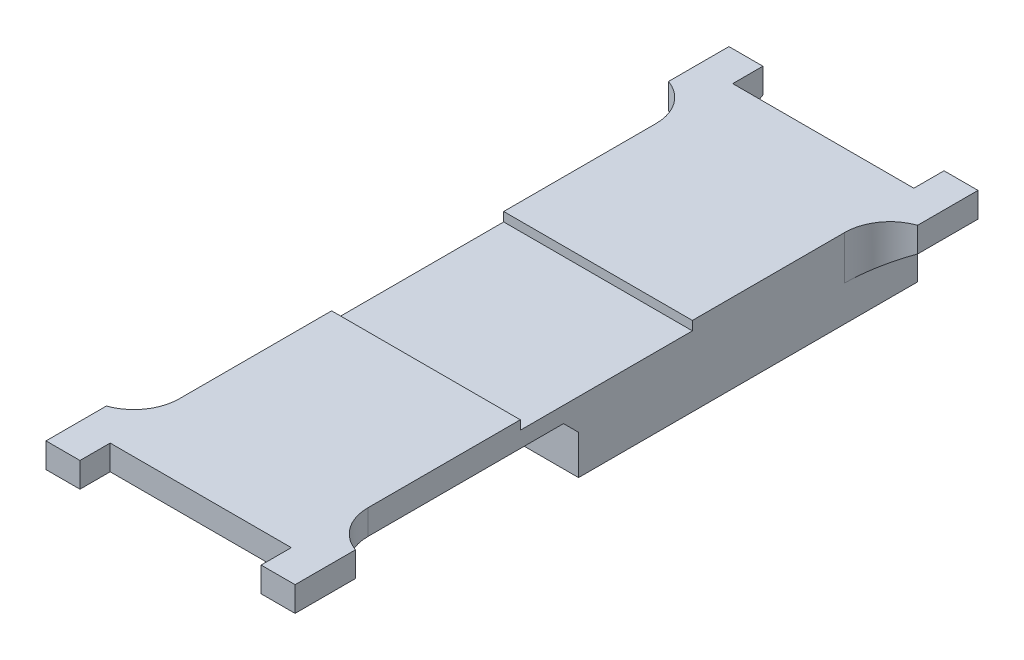
ISO-10303-21;
HEADER;
FILE_DESCRIPTION(('STEP AP214'),'2;1');
FILE_NAME('part.step','',(''),(''),'','','');
FILE_SCHEMA(('AUTOMOTIVE_DESIGN { 1 0 10303 214 1 1 1 1 }'));
ENDSEC;
DATA;
#1=APPLICATION_CONTEXT('core data for automotive mechanical design processes');
#2=APPLICATION_PROTOCOL_DEFINITION('international standard','automotive_design',2000,#1);
#3=PRODUCT_CONTEXT('',#1,'mechanical');
#4=PRODUCT('Part','Part','',(#3));
#5=PRODUCT_RELATED_PRODUCT_CATEGORY('part','',(#4));
#6=PRODUCT_DEFINITION_FORMATION('','',#4);
#7=PRODUCT_DEFINITION_CONTEXT('part definition',#1,'design');
#8=PRODUCT_DEFINITION('design','',#6,#7);
#9=PRODUCT_DEFINITION_SHAPE('','',#8);
#10=(LENGTH_UNIT() NAMED_UNIT(*) SI_UNIT(.MILLI.,.METRE.));
#11=(NAMED_UNIT(*) PLANE_ANGLE_UNIT() SI_UNIT($,.RADIAN.));
#12=(NAMED_UNIT(*) SI_UNIT($,.STERADIAN.) SOLID_ANGLE_UNIT());
#13=UNCERTAINTY_MEASURE_WITH_UNIT(LENGTH_MEASURE(1.E-05),#10,'distance_accuracy_value','');
#14=(GEOMETRIC_REPRESENTATION_CONTEXT(3) GLOBAL_UNCERTAINTY_ASSIGNED_CONTEXT((#13)) GLOBAL_UNIT_ASSIGNED_CONTEXT((#10,
#11,#12)) REPRESENTATION_CONTEXT('',''));
#15=CARTESIAN_POINT('',(0.,0.,0.));
#16=DIRECTION('',(0.,0.,1.));
#17=DIRECTION('',(1.,0.,0.));
#18=AXIS2_PLACEMENT_3D('',#15,#16,#17);
#19=CARTESIAN_POINT('',(0.,5.25,0.));
#20=DIRECTION('',(0.,1.,0.));
#21=DIRECTION('',(0.,0.,1.));
#22=AXIS2_PLACEMENT_3D('',#19,#20,#21);
#23=PLANE('',#22);
#24=DIRECTION('',(0.,0.,-1.));
#25=VECTOR('',#24,1.);
#26=CARTESIAN_POINT('',(-6.,5.25,18.62));
#27=LINE('',#26,#25);
#28=CARTESIAN_POINT('',(-6.,5.25,22.62));
#29=VERTEX_POINT('',#28);
#30=CARTESIAN_POINT('',(-6.,5.25,20.62));
#31=VERTEX_POINT('',#30);
#32=EDGE_CURVE('E262',#29,#31,#27,.T.);
#33=ORIENTED_EDGE('',*,*,#32,.T.);
#34=DIRECTION('',(1.,0.,0.));
#35=VECTOR('',#34,1.);
#36=CARTESIAN_POINT('',(0.,5.25,20.62));
#37=LINE('',#36,#35);
#38=CARTESIAN_POINT('',(6.,5.25,20.62));
#39=VERTEX_POINT('',#38);
#40=EDGE_CURVE('E433',#31,#39,#37,.T.);
#41=ORIENTED_EDGE('',*,*,#40,.T.);
#42=DIRECTION('',(0.,0.,1.));
#43=VECTOR('',#42,1.);
#44=CARTESIAN_POINT('',(6.,5.25,18.62));
#45=LINE('',#44,#43);
#46=CARTESIAN_POINT('',(6.,5.25,22.62));
#47=VERTEX_POINT('',#46);
#48=EDGE_CURVE('E279',#39,#47,#45,.T.);
#49=ORIENTED_EDGE('',*,*,#48,.T.);
#50=DIRECTION('',(1.,0.,0.));
#51=VECTOR('',#50,1.);
#52=CARTESIAN_POINT('',(6.,5.25,22.62));
#53=LINE('',#52,#51);
#54=CARTESIAN_POINT('',(8.25,5.25,22.62));
#55=VERTEX_POINT('',#54);
#56=EDGE_CURVE('E291',#47,#55,#53,.T.);
#57=ORIENTED_EDGE('',*,*,#56,.T.);
#58=DIRECTION('',(0.,0.,-1.));
#59=VECTOR('',#58,1.);
#60=CARTESIAN_POINT('',(8.25,5.25,18.62));
#61=LINE('',#60,#59);
#62=CARTESIAN_POINT('',(8.25,5.25,18.62));
#63=VERTEX_POINT('',#62);
#64=EDGE_CURVE('E295',#55,#63,#61,.T.);
#65=ORIENTED_EDGE('',*,*,#64,.T.);
#66=CARTESIAN_POINT('',(9.25,5.25,15.7915728752538));
#67=DIRECTION('',(0.,1.,0.));
#68=DIRECTION('',(0.,0.,1.));
#69=AXIS2_PLACEMENT_3D('',#66,#67,#68);
#70=CIRCLE('',#69,3.);
#71=CARTESIAN_POINT('',(6.25,5.25,15.7915728752538));
#72=VERTEX_POINT('',#71);
#73=EDGE_CURVE('E471',#63,#72,#70,.F.);
#74=ORIENTED_EDGE('',*,*,#73,.T.);
#75=DIRECTION('',(0.,0.,1.));
#76=VECTOR('',#75,1.);
#77=CARTESIAN_POINT('',(6.24999999999999,5.25,0.));
#78=LINE('',#77,#76);
#79=CARTESIAN_POINT('',(6.24999999999999,5.25,5.7));
#80=VERTEX_POINT('',#79);
#81=EDGE_CURVE('E426',#80,#72,#78,.T.);
#82=ORIENTED_EDGE('',*,*,#81,.F.);
#83=DIRECTION('',(1.,0.,0.));
#84=VECTOR('',#83,1.);
#85=CARTESIAN_POINT('',(-6.24999999999999,5.25,5.7));
#86=LINE('',#85,#84);
#87=CARTESIAN_POINT('',(-6.24999999999999,5.25,5.7));
#88=VERTEX_POINT('',#87);
#89=EDGE_CURVE('E371',#88,#80,#86,.T.);
#90=ORIENTED_EDGE('',*,*,#89,.F.);
#91=DIRECTION('',(0.,0.,1.));
#92=VECTOR('',#91,1.);
#93=CARTESIAN_POINT('',(-6.25,5.25,0.));
#94=LINE('',#93,#92);
#95=CARTESIAN_POINT('',(-6.25,5.25,15.7915728752538));
#96=VERTEX_POINT('',#95);
#97=EDGE_CURVE('E243',#88,#96,#94,.T.);
#98=ORIENTED_EDGE('',*,*,#97,.T.);
#99=CARTESIAN_POINT('',(-9.25,5.25,15.7915728752538));
#100=DIRECTION('',(0.,1.,0.));
#101=DIRECTION('',(0.,0.,1.));
#102=AXIS2_PLACEMENT_3D('',#99,#100,#101);
#103=CIRCLE('',#102,3.);
#104=CARTESIAN_POINT('',(-8.25,5.25,18.62));
#105=VERTEX_POINT('',#104);
#106=EDGE_CURVE('E235',#96,#105,#103,.F.);
#107=ORIENTED_EDGE('',*,*,#106,.T.);
#108=DIRECTION('',(0.,0.,1.));
#109=VECTOR('',#108,1.);
#110=CARTESIAN_POINT('',(-8.25,5.25,18.62));
#111=LINE('',#110,#109);
#112=CARTESIAN_POINT('',(-8.25,5.25,22.62));
#113=VERTEX_POINT('',#112);
#114=EDGE_CURVE('E239',#105,#113,#111,.T.);
#115=ORIENTED_EDGE('',*,*,#114,.T.);
#116=DIRECTION('',(1.,0.,0.));
#117=VECTOR('',#116,1.);
#118=CARTESIAN_POINT('',(-6.,5.25,22.62));
#119=LINE('',#118,#117);
#120=EDGE_CURVE('E261',#113,#29,#119,.T.);
#121=ORIENTED_EDGE('',*,*,#120,.T.);
#122=EDGE_LOOP('',(#33,#41,#49,#57,#65,#74,#82,#90,#98,#107,#115,#121));
#123=FACE_BOUND('',#122,.T.);
#124=ADVANCED_FACE('F43',(#123),#23,.T.);
#125=CARTESIAN_POINT('',(6.24999999999999,5.25,0.));
#126=DIRECTION('',(1.,0.,0.));
#127=DIRECTION('',(0.,0.,-1.));
#128=AXIS2_PLACEMENT_3D('',#125,#126,#127);
#129=PLANE('',#128);
#130=DIRECTION('',(0.,-1.,0.));
#131=VECTOR('',#130,1.);
#132=CARTESIAN_POINT('',(6.24999999999999,5.25,-20.62));
#133=LINE('',#132,#131);
#134=CARTESIAN_POINT('',(6.24999999999999,2.34999999999999,-20.62));
#135=VERTEX_POINT('',#134);
#136=CARTESIAN_POINT('',(6.24999999999999,0.,-20.62));
#137=VERTEX_POINT('',#136);
#138=EDGE_CURVE('E450',#135,#137,#133,.T.);
#139=ORIENTED_EDGE('',*,*,#138,.F.);
#140=DIRECTION('',(0.,0.,1.));
#141=VECTOR('',#140,1.);
#142=CARTESIAN_POINT('',(6.24999999999999,2.34999999999999,0.));
#143=LINE('',#142,#141);
#144=CARTESIAN_POINT('',(6.24999999999999,2.34999999999999,-15.7915728752538));
#145=VERTEX_POINT('',#144);
#146=EDGE_CURVE('E478',#135,#145,#143,.T.);
#147=ORIENTED_EDGE('',*,*,#146,.T.);
#148=DIRECTION('',(0.,-1.,0.));
#149=VECTOR('',#148,1.);
#150=CARTESIAN_POINT('',(6.24999999999999,5.25,-15.7915728752538));
#151=LINE('',#150,#149);
#152=CARTESIAN_POINT('',(6.24999999999999,5.25,-15.7915728752538));
#153=VERTEX_POINT('',#152);
#154=EDGE_CURVE('E456',#145,#153,#151,.F.);
#155=ORIENTED_EDGE('',*,*,#154,.T.);
#156=CARTESIAN_POINT('',(6.24999999999999,5.25,-5.7));
#157=VERTEX_POINT('',#156);
#158=EDGE_CURVE('E422',#153,#157,#78,.T.);
#159=ORIENTED_EDGE('',*,*,#158,.T.);
#160=DIRECTION('',(0.,1.,0.));
#161=VECTOR('',#160,1.);
#162=CARTESIAN_POINT('',(6.24999999999999,4.65,-5.7));
#163=LINE('',#162,#161);
#164=CARTESIAN_POINT('',(6.24999999999999,4.65,-5.7));
#165=VERTEX_POINT('',#164);
#166=EDGE_CURVE('E382',#165,#157,#163,.T.);
#167=ORIENTED_EDGE('',*,*,#166,.F.);
#168=DIRECTION('',(0.,0.,-1.));
#169=VECTOR('',#168,1.);
#170=CARTESIAN_POINT('',(6.24999999999999,4.65,5.7));
#171=LINE('',#170,#169);
#172=CARTESIAN_POINT('',(6.24999999999999,4.65,5.7));
#173=VERTEX_POINT('',#172);
#174=EDGE_CURVE('E366',#173,#165,#171,.T.);
#175=ORIENTED_EDGE('',*,*,#174,.F.);
#176=DIRECTION('',(0.,1.,0.));
#177=VECTOR('',#176,1.);
#178=CARTESIAN_POINT('',(6.24999999999999,4.65,5.7));
#179=LINE('',#178,#177);
#180=EDGE_CURVE('E388',#173,#80,#179,.T.);
#181=ORIENTED_EDGE('',*,*,#180,.T.);
#182=ORIENTED_EDGE('',*,*,#81,.T.);
#183=DIRECTION('',(0.,1.,0.));
#184=VECTOR('',#183,1.);
#185=CARTESIAN_POINT('',(6.25,3.6,15.7915728752538));
#186=LINE('',#185,#184);
#187=CARTESIAN_POINT('',(6.24999999999999,3.6,15.7915728752538));
#188=VERTEX_POINT('',#187);
#189=EDGE_CURVE('E453',#72,#188,#186,.F.);
#190=ORIENTED_EDGE('',*,*,#189,.T.);
#191=DIRECTION('',(0.,0.,-1.));
#192=VECTOR('',#191,1.);
#193=CARTESIAN_POINT('',(6.24999999999999,3.6,1.83999999999999));
#194=LINE('',#193,#192);
#195=CARTESIAN_POINT('',(6.24999999999999,3.6,2.83999999999997));
#196=VERTEX_POINT('',#195);
#197=EDGE_CURVE('E409',#188,#196,#194,.T.);
#198=ORIENTED_EDGE('',*,*,#197,.T.);
#199=DIRECTION('',(0.,-0.707106781186553,-0.707106781186542));
#200=VECTOR('',#199,1.);
#201=CARTESIAN_POINT('',(6.24999999999999,2.6,1.83999999999999));
#202=LINE('',#201,#200);
#203=CARTESIAN_POINT('',(6.24999999999999,2.60000000000001,1.83999999999999));
#204=VERTEX_POINT('',#203);
#205=EDGE_CURVE('E11',#196,#204,#202,.T.);
#206=ORIENTED_EDGE('',*,*,#205,.T.);
#207=DIRECTION('',(0.,-1.,0.));
#208=VECTOR('',#207,1.);
#209=CARTESIAN_POINT('',(6.24999999999999,3.6,1.83999999999999));
#210=LINE('',#209,#208);
#211=CARTESIAN_POINT('',(6.24999999999999,0.,1.83999999999999));
#212=VERTEX_POINT('',#211);
#213=EDGE_CURVE('E418',#204,#212,#210,.T.);
#214=ORIENTED_EDGE('',*,*,#213,.T.);
#215=DIRECTION('',(0.,0.,1.));
#216=VECTOR('',#215,1.);
#217=CARTESIAN_POINT('',(6.24999999999999,0.,0.));
#218=LINE('',#217,#216);
#219=EDGE_CURVE('E421',#137,#212,#218,.T.);
#220=ORIENTED_EDGE('',*,*,#219,.F.);
#221=EDGE_LOOP('',(#139,#147,#155,#159,#167,#175,#181,#182,#190,#198,#206,#214,#220));
#222=FACE_BOUND('',#221,.T.);
#223=ADVANCED_FACE('F583',(#222),#129,.T.);
#224=CARTESIAN_POINT('',(-6.25,5.25,0.));
#225=DIRECTION('',(1.,0.,0.));
#226=DIRECTION('',(0.,0.,-1.));
#227=AXIS2_PLACEMENT_3D('',#224,#225,#226);
#228=PLANE('',#227);
#229=DIRECTION('',(0.,-1.,0.));
#230=VECTOR('',#229,1.);
#231=CARTESIAN_POINT('',(-6.25,5.25,-15.7915728752538));
#232=LINE('',#231,#230);
#233=CARTESIAN_POINT('',(-6.25,5.25,-15.7915728752538));
#234=VERTEX_POINT('',#233);
#235=CARTESIAN_POINT('',(-6.25,2.34999999999999,-15.7915728752538));
#236=VERTEX_POINT('',#235);
#237=EDGE_CURVE('E462',#234,#236,#232,.T.);
#238=ORIENTED_EDGE('',*,*,#237,.T.);
#239=DIRECTION('',(0.,0.,-1.));
#240=VECTOR('',#239,1.);
#241=CARTESIAN_POINT('',(-6.25,2.34999999999999,-20.62));
#242=LINE('',#241,#240);
#243=CARTESIAN_POINT('',(-6.25,2.34999999999999,-20.62));
#244=VERTEX_POINT('',#243);
#245=EDGE_CURVE('E489',#236,#244,#242,.T.);
#246=ORIENTED_EDGE('',*,*,#245,.T.);
#247=DIRECTION('',(0.,-1.,0.));
#248=VECTOR('',#247,1.);
#249=CARTESIAN_POINT('',(-6.25,5.25,-20.62));
#250=LINE('',#249,#248);
#251=CARTESIAN_POINT('',(-6.25,0.,-20.62));
#252=VERTEX_POINT('',#251);
#253=EDGE_CURVE('E436',#244,#252,#250,.T.);
#254=ORIENTED_EDGE('',*,*,#253,.T.);
#255=DIRECTION('',(0.,0.,1.));
#256=VECTOR('',#255,1.);
#257=CARTESIAN_POINT('',(-6.25,0.,0.));
#258=LINE('',#257,#256);
#259=CARTESIAN_POINT('',(-6.25,0.,1.83999999999999));
#260=VERTEX_POINT('',#259);
#261=EDGE_CURVE('E444',#252,#260,#258,.T.);
#262=ORIENTED_EDGE('',*,*,#261,.T.);
#263=DIRECTION('',(0.,-1.,0.));
#264=VECTOR('',#263,1.);
#265=CARTESIAN_POINT('',(-6.25,3.6,1.83999999999999));
#266=LINE('',#265,#264);
#267=CARTESIAN_POINT('',(-6.25,2.60000000000001,1.83999999999999));
#268=VERTEX_POINT('',#267);
#269=EDGE_CURVE('E412',#268,#260,#266,.T.);
#270=ORIENTED_EDGE('',*,*,#269,.F.);
#271=DIRECTION('',(0.,0.707106781186553,0.707106781186542));
#272=VECTOR('',#271,1.);
#273=CARTESIAN_POINT('',(-6.25,3.00500000000003,2.24500000000001));
#274=LINE('',#273,#272);
#275=CARTESIAN_POINT('',(-6.25,3.6,2.83999999999997));
#276=VERTEX_POINT('',#275);
#277=EDGE_CURVE('E53',#268,#276,#274,.T.);
#278=ORIENTED_EDGE('',*,*,#277,.T.);
#279=DIRECTION('',(0.,0.,1.));
#280=VECTOR('',#279,1.);
#281=CARTESIAN_POINT('',(-6.25,3.6,1.83999999999999));
#282=LINE('',#281,#280);
#283=CARTESIAN_POINT('',(-6.25,3.6,15.7915728752538));
#284=VERTEX_POINT('',#283);
#285=EDGE_CURVE('E403',#276,#284,#282,.T.);
#286=ORIENTED_EDGE('',*,*,#285,.T.);
#287=DIRECTION('',(0.,1.,0.));
#288=VECTOR('',#287,1.);
#289=CARTESIAN_POINT('',(-6.25,5.25,15.7915728752538));
#290=LINE('',#289,#288);
#291=EDGE_CURVE('E459',#284,#96,#290,.T.);
#292=ORIENTED_EDGE('',*,*,#291,.T.);
#293=ORIENTED_EDGE('',*,*,#97,.F.);
#294=DIRECTION('',(0.,1.,0.));
#295=VECTOR('',#294,1.);
#296=CARTESIAN_POINT('',(-6.24999999999999,4.65,5.7));
#297=LINE('',#296,#295);
#298=CARTESIAN_POINT('',(-6.24999999999999,4.65,5.7));
#299=VERTEX_POINT('',#298);
#300=EDGE_CURVE('E393',#299,#88,#297,.T.);
#301=ORIENTED_EDGE('',*,*,#300,.F.);
#302=DIRECTION('',(0.,0.,1.));
#303=VECTOR('',#302,1.);
#304=CARTESIAN_POINT('',(-6.24999999999999,4.65,5.7));
#305=LINE('',#304,#303);
#306=CARTESIAN_POINT('',(-6.24999999999999,4.65,-5.7));
#307=VERTEX_POINT('',#306);
#308=EDGE_CURVE('E375',#307,#299,#305,.T.);
#309=ORIENTED_EDGE('',*,*,#308,.F.);
#310=DIRECTION('',(0.,1.,0.));
#311=VECTOR('',#310,1.);
#312=CARTESIAN_POINT('',(-6.24999999999999,4.65,-5.7));
#313=LINE('',#312,#311);
#314=CARTESIAN_POINT('',(-6.24999999999999,5.25,-5.7));
#315=VERTEX_POINT('',#314);
#316=EDGE_CURVE('E396',#307,#315,#313,.T.);
#317=ORIENTED_EDGE('',*,*,#316,.T.);
#318=EDGE_CURVE('E430',#234,#315,#94,.T.);
#319=ORIENTED_EDGE('',*,*,#318,.F.);
#320=EDGE_LOOP('',(#238,#246,#254,#262,#270,#278,#286,#292,#293,#301,#309,#317,#319));
#321=FACE_BOUND('',#320,.T.);
#322=ADVANCED_FACE('F593',(#321),#228,.F.);
#323=CARTESIAN_POINT('',(0.,0.,0.));
#324=DIRECTION('',(0.,1.,0.));
#325=DIRECTION('',(0.,0.,1.));
#326=AXIS2_PLACEMENT_3D('',#323,#324,#325);
#327=PLANE('',#326);
#328=DIRECTION('',(-1.,0.,0.));
#329=VECTOR('',#328,1.);
#330=CARTESIAN_POINT('',(-6.25,0.,1.83999999999999));
#331=LINE('',#330,#329);
#332=EDGE_CURVE('E392',#212,#260,#331,.T.);
#333=ORIENTED_EDGE('',*,*,#332,.T.);
#334=ORIENTED_EDGE('',*,*,#261,.F.);
#335=DIRECTION('',(1.,0.,0.));
#336=VECTOR('',#335,1.);
#337=CARTESIAN_POINT('',(0.,0.,-20.62));
#338=LINE('',#337,#336);
#339=EDGE_CURVE('E440',#252,#137,#338,.T.);
#340=ORIENTED_EDGE('',*,*,#339,.T.);
#341=ORIENTED_EDGE('',*,*,#219,.T.);
#342=EDGE_LOOP('',(#333,#334,#340,#341));
#343=FACE_BOUND('',#342,.T.);
#344=ADVANCED_FACE('F698',(#343),#327,.F.);
#345=CARTESIAN_POINT('',(0.,5.25,-20.62));
#346=DIRECTION('',(0.,0.,-1.));
#347=DIRECTION('',(-1.,0.,0.));
#348=AXIS2_PLACEMENT_3D('',#345,#346,#347);
#349=PLANE('',#348);
#350=DIRECTION('',(0.,1.,0.));
#351=VECTOR('',#350,1.);
#352=CARTESIAN_POINT('',(6.,5.25,-20.62));
#353=LINE('',#352,#351);
#354=CARTESIAN_POINT('',(6.,2.34999999999999,-20.62));
#355=VERTEX_POINT('',#354);
#356=CARTESIAN_POINT('',(6.,5.25,-20.62));
#357=VERTEX_POINT('',#356);
#358=EDGE_CURVE('E332',#355,#357,#353,.T.);
#359=ORIENTED_EDGE('',*,*,#358,.F.);
#360=DIRECTION('',(1.,0.,0.));
#361=VECTOR('',#360,1.);
#362=CARTESIAN_POINT('',(0.,2.34999999999999,-20.62));
#363=LINE('',#362,#361);
#364=EDGE_CURVE('E486',#355,#135,#363,.T.);
#365=ORIENTED_EDGE('',*,*,#364,.T.);
#366=ORIENTED_EDGE('',*,*,#138,.T.);
#367=ORIENTED_EDGE('',*,*,#339,.F.);
#368=ORIENTED_EDGE('',*,*,#253,.F.);
#369=DIRECTION('',(1.,0.,0.));
#370=VECTOR('',#369,1.);
#371=CARTESIAN_POINT('',(0.,2.34999999999999,-20.62));
#372=LINE('',#371,#370);
#373=CARTESIAN_POINT('',(-6.,2.34999999999999,-20.62));
#374=VERTEX_POINT('',#373);
#375=EDGE_CURVE('E482',#244,#374,#372,.T.);
#376=ORIENTED_EDGE('',*,*,#375,.T.);
#377=DIRECTION('',(0.,-1.,0.));
#378=VECTOR('',#377,1.);
#379=CARTESIAN_POINT('',(-6.,5.25,-20.62));
#380=LINE('',#379,#378);
#381=CARTESIAN_POINT('',(-6.,5.25,-20.62));
#382=VERTEX_POINT('',#381);
#383=EDGE_CURVE('E356',#382,#374,#380,.T.);
#384=ORIENTED_EDGE('',*,*,#383,.F.);
#385=DIRECTION('',(1.,0.,0.));
#386=VECTOR('',#385,1.);
#387=CARTESIAN_POINT('',(0.,5.25,-20.62));
#388=LINE('',#387,#386);
#389=EDGE_CURVE('E425',#382,#357,#388,.T.);
#390=ORIENTED_EDGE('',*,*,#389,.T.);
#391=EDGE_LOOP('',(#359,#365,#366,#367,#368,#376,#384,#390));
#392=FACE_BOUND('',#391,.T.);
#393=ADVANCED_FACE('F624',(#392),#349,.T.);
#394=CARTESIAN_POINT('',(0.,5.25,20.62));
#395=DIRECTION('',(0.,0.,-1.));
#396=DIRECTION('',(-1.,0.,0.));
#397=AXIS2_PLACEMENT_3D('',#394,#395,#396);
#398=PLANE('',#397);
#399=ORIENTED_EDGE('',*,*,#40,.F.);
#400=DIRECTION('',(0.,-1.,0.));
#401=VECTOR('',#400,1.);
#402=CARTESIAN_POINT('',(-6.,5.25,20.62));
#403=LINE('',#402,#401);
#404=CARTESIAN_POINT('',(-6.,3.6,20.62));
#405=VERTEX_POINT('',#404);
#406=EDGE_CURVE('E275',#31,#405,#403,.T.);
#407=ORIENTED_EDGE('',*,*,#406,.T.);
#408=DIRECTION('',(1.,0.,0.));
#409=VECTOR('',#408,1.);
#410=CARTESIAN_POINT('',(-6.25,3.6,20.62));
#411=LINE('',#410,#409);
#412=CARTESIAN_POINT('',(6.,3.6,20.62));
#413=VERTEX_POINT('',#412);
#414=EDGE_CURVE('E406',#405,#413,#411,.T.);
#415=ORIENTED_EDGE('',*,*,#414,.T.);
#416=DIRECTION('',(0.,1.,0.));
#417=VECTOR('',#416,1.);
#418=CARTESIAN_POINT('',(6.,5.25,20.62));
#419=LINE('',#418,#417);
#420=EDGE_CURVE('E312',#413,#39,#419,.T.);
#421=ORIENTED_EDGE('',*,*,#420,.T.);
#422=EDGE_LOOP('',(#399,#407,#415,#421));
#423=FACE_BOUND('',#422,.T.);
#424=ADVANCED_FACE('F561',(#423),#398,.F.);
#425=ORIENTED_EDGE('',*,*,#158,.F.);
#426=CARTESIAN_POINT('',(9.24999999999999,5.25,-15.7915728752538));
#427=DIRECTION('',(0.,1.,0.));
#428=DIRECTION('',(0.,0.,1.));
#429=AXIS2_PLACEMENT_3D('',#426,#427,#428);
#430=CIRCLE('',#429,3.);
#431=CARTESIAN_POINT('',(8.25,5.25,-18.62));
#432=VERTEX_POINT('',#431);
#433=EDGE_CURVE('E465',#153,#432,#430,.F.);
#434=ORIENTED_EDGE('',*,*,#433,.T.);
#435=DIRECTION('',(0.,0.,-1.));
#436=VECTOR('',#435,1.);
#437=CARTESIAN_POINT('',(8.25,5.25,-18.62));
#438=LINE('',#437,#436);
#439=CARTESIAN_POINT('',(8.25,5.25,-22.62));
#440=VERTEX_POINT('',#439);
#441=EDGE_CURVE('E320',#432,#440,#438,.T.);
#442=ORIENTED_EDGE('',*,*,#441,.T.);
#443=DIRECTION('',(-1.,0.,0.));
#444=VECTOR('',#443,1.);
#445=CARTESIAN_POINT('',(6.,5.25,-22.62));
#446=LINE('',#445,#444);
#447=CARTESIAN_POINT('',(6.,5.25,-22.62));
#448=VERTEX_POINT('',#447);
#449=EDGE_CURVE('E324',#440,#448,#446,.T.);
#450=ORIENTED_EDGE('',*,*,#449,.T.);
#451=DIRECTION('',(0.,0.,1.));
#452=VECTOR('',#451,1.);
#453=CARTESIAN_POINT('',(6.,5.25,-18.62));
#454=LINE('',#453,#452);
#455=EDGE_CURVE('E316',#448,#357,#454,.T.);
#456=ORIENTED_EDGE('',*,*,#455,.T.);
#457=ORIENTED_EDGE('',*,*,#389,.F.);
#458=DIRECTION('',(0.,0.,-1.));
#459=VECTOR('',#458,1.);
#460=CARTESIAN_POINT('',(-6.,5.25,-18.62));
#461=LINE('',#460,#459);
#462=CARTESIAN_POINT('',(-6.,5.25,-22.62));
#463=VERTEX_POINT('',#462);
#464=EDGE_CURVE('E341',#382,#463,#461,.T.);
#465=ORIENTED_EDGE('',*,*,#464,.T.);
#466=DIRECTION('',(-1.,0.,0.));
#467=VECTOR('',#466,1.);
#468=CARTESIAN_POINT('',(-6.,5.25,-22.62));
#469=LINE('',#468,#467);
#470=CARTESIAN_POINT('',(-8.25,5.25,-22.62));
#471=VERTEX_POINT('',#470);
#472=EDGE_CURVE('E344',#463,#471,#469,.T.);
#473=ORIENTED_EDGE('',*,*,#472,.T.);
#474=DIRECTION('',(0.,0.,1.));
#475=VECTOR('',#474,1.);
#476=CARTESIAN_POINT('',(-8.25,5.25,-18.62));
#477=LINE('',#476,#475);
#478=CARTESIAN_POINT('',(-8.25,5.25,-18.62));
#479=VERTEX_POINT('',#478);
#480=EDGE_CURVE('E348',#471,#479,#477,.T.);
#481=ORIENTED_EDGE('',*,*,#480,.T.);
#482=CARTESIAN_POINT('',(-9.25,5.25,-15.7915728752538));
#483=DIRECTION('',(0.,1.,0.));
#484=DIRECTION('',(0.,0.,1.));
#485=AXIS2_PLACEMENT_3D('',#482,#483,#484);
#486=CIRCLE('',#485,3.);
#487=EDGE_CURVE('E468',#479,#234,#486,.F.);
#488=ORIENTED_EDGE('',*,*,#487,.T.);
#489=ORIENTED_EDGE('',*,*,#318,.T.);
#490=DIRECTION('',(-1.,0.,0.));
#491=VECTOR('',#490,1.);
#492=CARTESIAN_POINT('',(-6.24999999999999,5.25,-5.7));
#493=LINE('',#492,#491);
#494=EDGE_CURVE('E365',#157,#315,#493,.T.);
#495=ORIENTED_EDGE('',*,*,#494,.F.);
#496=EDGE_LOOP('',(#425,#434,#442,#450,#456,#457,#465,#473,#481,#488,#489,#495));
#497=FACE_BOUND('',#496,.T.);
#498=ADVANCED_FACE('F609',(#497),#23,.T.);
#499=CARTESIAN_POINT('',(-6.25,3.6,1.83999999999999));
#500=DIRECTION('',(0.,0.,1.));
#501=DIRECTION('',(1.,0.,0.));
#502=AXIS2_PLACEMENT_3D('',#499,#500,#501);
#503=PLANE('',#502);
#504=ORIENTED_EDGE('',*,*,#213,.F.);
#505=DIRECTION('',(-1.,0.,0.));
#506=VECTOR('',#505,1.);
#507=CARTESIAN_POINT('',(-6.25,2.60000000000001,1.83999999999999));
#508=LINE('',#507,#506);
#509=EDGE_CURVE('E524',#204,#268,#508,.T.);
#510=ORIENTED_EDGE('',*,*,#509,.T.);
#511=ORIENTED_EDGE('',*,*,#269,.T.);
#512=ORIENTED_EDGE('',*,*,#332,.F.);
#513=EDGE_LOOP('',(#504,#510,#511,#512));
#514=FACE_BOUND('',#513,.T.);
#515=ADVANCED_FACE('F617',(#514),#503,.T.);
#516=CARTESIAN_POINT('',(0.,3.6,0.));
#517=DIRECTION('',(0.,1.,0.));
#518=DIRECTION('',(0.,0.,1.));
#519=AXIS2_PLACEMENT_3D('',#516,#517,#518);
#520=PLANE('',#519);
#521=ORIENTED_EDGE('',*,*,#285,.F.);
#522=DIRECTION('',(1.,0.,0.));
#523=VECTOR('',#522,1.);
#524=CARTESIAN_POINT('',(0.,3.6,2.83999999999997));
#525=LINE('',#524,#523);
#526=EDGE_CURVE('E60',#276,#196,#525,.T.);
#527=ORIENTED_EDGE('',*,*,#526,.T.);
#528=ORIENTED_EDGE('',*,*,#197,.F.);
#529=CARTESIAN_POINT('',(9.25,3.6,15.7915728752538));
#530=DIRECTION('',(0.,1.,0.));
#531=DIRECTION('',(0.,0.,1.));
#532=AXIS2_PLACEMENT_3D('',#529,#530,#531);
#533=CIRCLE('',#532,3.);
#534=CARTESIAN_POINT('',(8.25,3.6,18.62));
#535=VERTEX_POINT('',#534);
#536=EDGE_CURVE('E250',#188,#535,#533,.T.);
#537=ORIENTED_EDGE('',*,*,#536,.T.);
#538=DIRECTION('',(0.,0.,1.));
#539=VECTOR('',#538,1.);
#540=CARTESIAN_POINT('',(8.25,3.6,18.62));
#541=LINE('',#540,#539);
#542=CARTESIAN_POINT('',(8.25,3.6,22.62));
#543=VERTEX_POINT('',#542);
#544=EDGE_CURVE('E284',#535,#543,#541,.T.);
#545=ORIENTED_EDGE('',*,*,#544,.T.);
#546=DIRECTION('',(-1.,0.,0.));
#547=VECTOR('',#546,1.);
#548=CARTESIAN_POINT('',(6.,3.6,22.62));
#549=LINE('',#548,#547);
#550=CARTESIAN_POINT('',(6.,3.6,22.62));
#551=VERTEX_POINT('',#550);
#552=EDGE_CURVE('E281',#543,#551,#549,.T.);
#553=ORIENTED_EDGE('',*,*,#552,.T.);
#554=DIRECTION('',(0.,0.,-1.));
#555=VECTOR('',#554,1.);
#556=CARTESIAN_POINT('',(6.,3.6,18.62));
#557=LINE('',#556,#555);
#558=EDGE_CURVE('E288',#551,#413,#557,.T.);
#559=ORIENTED_EDGE('',*,*,#558,.T.);
#560=ORIENTED_EDGE('',*,*,#414,.F.);
#561=DIRECTION('',(0.,0.,1.));
#562=VECTOR('',#561,1.);
#563=CARTESIAN_POINT('',(-6.,3.6,18.62));
#564=LINE('',#563,#562);
#565=CARTESIAN_POINT('',(-6.,3.6,22.62));
#566=VERTEX_POINT('',#565);
#567=EDGE_CURVE('E280',#405,#566,#564,.T.);
#568=ORIENTED_EDGE('',*,*,#567,.T.);
#569=DIRECTION('',(-1.,0.,0.));
#570=VECTOR('',#569,1.);
#571=CARTESIAN_POINT('',(-6.,3.6,22.62));
#572=LINE('',#571,#570);
#573=CARTESIAN_POINT('',(-8.25,3.6,22.62));
#574=VERTEX_POINT('',#573);
#575=EDGE_CURVE('E543',#566,#574,#572,.T.);
#576=ORIENTED_EDGE('',*,*,#575,.T.);
#577=DIRECTION('',(0.,0.,-1.));
#578=VECTOR('',#577,1.);
#579=CARTESIAN_POINT('',(-8.25,3.6,18.62));
#580=LINE('',#579,#578);
#581=CARTESIAN_POINT('',(-8.25,3.6,18.62));
#582=VERTEX_POINT('',#581);
#583=EDGE_CURVE('E546',#574,#582,#580,.T.);
#584=ORIENTED_EDGE('',*,*,#583,.T.);
#585=CARTESIAN_POINT('',(-9.25,3.6,15.7915728752538));
#586=DIRECTION('',(0.,1.,0.));
#587=DIRECTION('',(0.,0.,1.));
#588=AXIS2_PLACEMENT_3D('',#585,#586,#587);
#589=CIRCLE('',#588,3.);
#590=EDGE_CURVE('E249',#582,#284,#589,.T.);
#591=ORIENTED_EDGE('',*,*,#590,.T.);
#592=EDGE_LOOP('',(#521,#527,#528,#537,#545,#553,#559,#560,#568,#576,#584,#591));
#593=FACE_BOUND('',#592,.T.);
#594=ADVANCED_FACE('F595',(#593),#520,.F.);
#595=CARTESIAN_POINT('',(-6.24999999999999,4.65,5.7));
#596=DIRECTION('',(0.,0.,1.));
#597=DIRECTION('',(1.,0.,0.));
#598=AXIS2_PLACEMENT_3D('',#595,#596,#597);
#599=PLANE('',#598);
#600=ORIENTED_EDGE('',*,*,#89,.T.);
#601=ORIENTED_EDGE('',*,*,#180,.F.);
#602=DIRECTION('',(1.,0.,0.));
#603=VECTOR('',#602,1.);
#604=CARTESIAN_POINT('',(-6.24999999999999,4.65,5.7));
#605=LINE('',#604,#603);
#606=EDGE_CURVE('E378',#299,#173,#605,.T.);
#607=ORIENTED_EDGE('',*,*,#606,.F.);
#608=ORIENTED_EDGE('',*,*,#300,.T.);
#609=EDGE_LOOP('',(#600,#601,#607,#608));
#610=FACE_BOUND('',#609,.T.);
#611=ADVANCED_FACE('F588',(#610),#599,.F.);
#612=CARTESIAN_POINT('',(-6.24999999999999,4.65,-5.7));
#613=DIRECTION('',(0.,0.,-1.));
#614=DIRECTION('',(-1.,0.,0.));
#615=AXIS2_PLACEMENT_3D('',#612,#613,#614);
#616=PLANE('',#615);
#617=ORIENTED_EDGE('',*,*,#494,.T.);
#618=ORIENTED_EDGE('',*,*,#316,.F.);
#619=DIRECTION('',(-1.,0.,0.));
#620=VECTOR('',#619,1.);
#621=CARTESIAN_POINT('',(-6.24999999999999,4.65,-5.7));
#622=LINE('',#621,#620);
#623=EDGE_CURVE('E370',#165,#307,#622,.T.);
#624=ORIENTED_EDGE('',*,*,#623,.F.);
#625=ORIENTED_EDGE('',*,*,#166,.T.);
#626=EDGE_LOOP('',(#617,#618,#624,#625));
#627=FACE_BOUND('',#626,.T.);
#628=ADVANCED_FACE('F671',(#627),#616,.F.);
#629=CARTESIAN_POINT('',(0.,4.65,0.));
#630=DIRECTION('',(0.,-1.,0.));
#631=DIRECTION('',(0.,0.,-1.));
#632=AXIS2_PLACEMENT_3D('',#629,#630,#631);
#633=PLANE('',#632);
#634=ORIENTED_EDGE('',*,*,#174,.T.);
#635=ORIENTED_EDGE('',*,*,#623,.T.);
#636=ORIENTED_EDGE('',*,*,#308,.T.);
#637=ORIENTED_EDGE('',*,*,#606,.T.);
#638=EDGE_LOOP('',(#634,#635,#636,#637));
#639=FACE_BOUND('',#638,.T.);
#640=ADVANCED_FACE('F591',(#639),#633,.F.);
#641=CARTESIAN_POINT('',(-6.,-0.989389937671457,-18.62));
#642=DIRECTION('',(1.,0.,0.));
#643=DIRECTION('',(0.,0.,-1.));
#644=AXIS2_PLACEMENT_3D('',#641,#642,#643);
#645=PLANE('',#644);
#646=ORIENTED_EDGE('',*,*,#464,.F.);
#647=ORIENTED_EDGE('',*,*,#383,.T.);
#648=DIRECTION('',(0.,0.529919264233202,-0.848048096156428));
#649=VECTOR('',#648,1.);
#650=CARTESIAN_POINT('',(-6.,2.34999999999999,-20.62));
#651=LINE('',#650,#649);
#652=CARTESIAN_POINT('',(-6.,3.59973870381863,-22.62));
#653=VERTEX_POINT('',#652);
#654=EDGE_CURVE('E508',#374,#653,#651,.T.);
#655=ORIENTED_EDGE('',*,*,#654,.T.);
#656=DIRECTION('',(0.,1.,0.));
#657=VECTOR('',#656,1.);
#658=CARTESIAN_POINT('',(-6.,-0.989389937671457,-22.62));
#659=LINE('',#658,#657);
#660=EDGE_CURVE('E352',#653,#463,#659,.T.);
#661=ORIENTED_EDGE('',*,*,#660,.T.);
#662=EDGE_LOOP('',(#646,#647,#655,#661));
#663=FACE_BOUND('',#662,.T.);
#664=ADVANCED_FACE('F650',(#663),#645,.T.);
#665=CARTESIAN_POINT('',(-8.25,-0.989389937671457,-18.62));
#666=DIRECTION('',(-1.,0.,0.));
#667=DIRECTION('',(0.,0.,1.));
#668=AXIS2_PLACEMENT_3D('',#665,#666,#667);
#669=PLANE('',#668);
#670=DIRECTION('',(0.,1.,0.));
#671=VECTOR('',#670,1.);
#672=CARTESIAN_POINT('',(-8.25,-0.989389937671457,-22.62));
#673=LINE('',#672,#671);
#674=CARTESIAN_POINT('',(-8.25,3.59973870381863,-22.62));
#675=VERTEX_POINT('',#674);
#676=EDGE_CURVE('E357',#675,#471,#673,.T.);
#677=ORIENTED_EDGE('',*,*,#676,.F.);
#678=DIRECTION('',(0.,0.,-1.));
#679=VECTOR('',#678,1.);
#680=CARTESIAN_POINT('',(-8.25,3.59973870381863,0.));
#681=LINE('',#680,#679);
#682=CARTESIAN_POINT('',(-8.25,3.59973870381863,-18.62));
#683=VERTEX_POINT('',#682);
#684=EDGE_CURVE('E520',#675,#683,#681,.F.);
#685=ORIENTED_EDGE('',*,*,#684,.T.);
#686=DIRECTION('',(0.,1.,0.));
#687=VECTOR('',#686,1.);
#688=CARTESIAN_POINT('',(-8.25,-0.989389937671457,-18.62));
#689=LINE('',#688,#687);
#690=EDGE_CURVE('E353',#683,#479,#689,.T.);
#691=ORIENTED_EDGE('',*,*,#690,.T.);
#692=ORIENTED_EDGE('',*,*,#480,.F.);
#693=EDGE_LOOP('',(#677,#685,#691,#692));
#694=FACE_BOUND('',#693,.T.);
#695=ADVANCED_FACE('F665',(#694),#669,.T.);
#696=CARTESIAN_POINT('',(-6.,-0.989389937671457,-22.62));
#697=DIRECTION('',(0.,0.,-1.));
#698=DIRECTION('',(-1.,0.,0.));
#699=AXIS2_PLACEMENT_3D('',#696,#697,#698);
#700=PLANE('',#699);
#701=DIRECTION('',(-1.,0.,0.));
#702=VECTOR('',#701,1.);
#703=CARTESIAN_POINT('',(0.,3.59973870381863,-22.62));
#704=LINE('',#703,#702);
#705=EDGE_CURVE('E512',#653,#675,#704,.T.);
#706=ORIENTED_EDGE('',*,*,#705,.T.);
#707=ORIENTED_EDGE('',*,*,#676,.T.);
#708=ORIENTED_EDGE('',*,*,#472,.F.);
#709=ORIENTED_EDGE('',*,*,#660,.F.);
#710=EDGE_LOOP('',(#706,#707,#708,#709));
#711=FACE_BOUND('',#710,.T.);
#712=ADVANCED_FACE('F657',(#711),#700,.T.);
#713=CARTESIAN_POINT('',(6.,-0.989389937671457,-18.62));
#714=DIRECTION('',(-1.,0.,0.));
#715=DIRECTION('',(0.,0.,1.));
#716=AXIS2_PLACEMENT_3D('',#713,#714,#715);
#717=PLANE('',#716);
#718=DIRECTION('',(0.,1.,0.));
#719=VECTOR('',#718,1.);
#720=CARTESIAN_POINT('',(6.,-0.989389937671457,-22.62));
#721=LINE('',#720,#719);
#722=CARTESIAN_POINT('',(6.,3.59973870381863,-22.62));
#723=VERTEX_POINT('',#722);
#724=EDGE_CURVE('E329',#723,#448,#721,.T.);
#725=ORIENTED_EDGE('',*,*,#724,.F.);
#726=DIRECTION('',(0.,-0.529919264233202,0.848048096156428));
#727=VECTOR('',#726,1.);
#728=CARTESIAN_POINT('',(6.,2.34999999999999,-20.62));
#729=LINE('',#728,#727);
#730=EDGE_CURVE('E504',#723,#355,#729,.T.);
#731=ORIENTED_EDGE('',*,*,#730,.T.);
#732=ORIENTED_EDGE('',*,*,#358,.T.);
#733=ORIENTED_EDGE('',*,*,#455,.F.);
#734=EDGE_LOOP('',(#725,#731,#732,#733));
#735=FACE_BOUND('',#734,.T.);
#736=ADVANCED_FACE('F642',(#735),#717,.T.);
#737=CARTESIAN_POINT('',(6.,-0.989389937671457,-22.62));
#738=DIRECTION('',(0.,0.,-1.));
#739=DIRECTION('',(-1.,0.,0.));
#740=AXIS2_PLACEMENT_3D('',#737,#738,#739);
#741=PLANE('',#740);
#742=DIRECTION('',(0.,1.,0.));
#743=VECTOR('',#742,1.);
#744=CARTESIAN_POINT('',(8.25,-0.989389937671457,-22.62));
#745=LINE('',#744,#743);
#746=CARTESIAN_POINT('',(8.25,3.59973870381863,-22.62));
#747=VERTEX_POINT('',#746);
#748=EDGE_CURVE('E333',#747,#440,#745,.T.);
#749=ORIENTED_EDGE('',*,*,#748,.F.);
#750=DIRECTION('',(-1.,0.,0.));
#751=VECTOR('',#750,1.);
#752=CARTESIAN_POINT('',(0.,3.59973870381863,-22.62));
#753=LINE('',#752,#751);
#754=EDGE_CURVE('E500',#747,#723,#753,.T.);
#755=ORIENTED_EDGE('',*,*,#754,.T.);
#756=ORIENTED_EDGE('',*,*,#724,.T.);
#757=ORIENTED_EDGE('',*,*,#449,.F.);
#758=EDGE_LOOP('',(#749,#755,#756,#757));
#759=FACE_BOUND('',#758,.T.);
#760=ADVANCED_FACE('F638',(#759),#741,.T.);
#761=CARTESIAN_POINT('',(8.25,-0.989389937671457,-18.62));
#762=DIRECTION('',(1.,0.,0.));
#763=DIRECTION('',(0.,0.,-1.));
#764=AXIS2_PLACEMENT_3D('',#761,#762,#763);
#765=PLANE('',#764);
#766=DIRECTION('',(0.,0.,-1.));
#767=VECTOR('',#766,1.);
#768=CARTESIAN_POINT('',(8.25,3.59973870381863,0.));
#769=LINE('',#768,#767);
#770=CARTESIAN_POINT('',(8.25,3.59973870381864,-18.62));
#771=VERTEX_POINT('',#770);
#772=EDGE_CURVE('E496',#771,#747,#769,.T.);
#773=ORIENTED_EDGE('',*,*,#772,.T.);
#774=ORIENTED_EDGE('',*,*,#748,.T.);
#775=ORIENTED_EDGE('',*,*,#441,.F.);
#776=DIRECTION('',(0.,1.,0.));
#777=VECTOR('',#776,1.);
#778=CARTESIAN_POINT('',(8.25,-0.989389937671457,-18.62));
#779=LINE('',#778,#777);
#780=EDGE_CURVE('E328',#771,#432,#779,.T.);
#781=ORIENTED_EDGE('',*,*,#780,.F.);
#782=EDGE_LOOP('',(#773,#774,#775,#781));
#783=FACE_BOUND('',#782,.T.);
#784=ADVANCED_FACE('F634',(#783),#765,.T.);
#785=CARTESIAN_POINT('',(6.,-0.989389937671457,18.62));
#786=DIRECTION('',(-1.,0.,0.));
#787=DIRECTION('',(0.,0.,1.));
#788=AXIS2_PLACEMENT_3D('',#785,#786,#787);
#789=PLANE('',#788);
#790=ORIENTED_EDGE('',*,*,#420,.F.);
#791=ORIENTED_EDGE('',*,*,#558,.F.);
#792=DIRECTION('',(0.,1.,0.));
#793=VECTOR('',#792,1.);
#794=CARTESIAN_POINT('',(6.,-0.989389937671457,22.62));
#795=LINE('',#794,#793);
#796=EDGE_CURVE('E299',#551,#47,#795,.T.);
#797=ORIENTED_EDGE('',*,*,#796,.T.);
#798=ORIENTED_EDGE('',*,*,#48,.F.);
#799=EDGE_LOOP('',(#790,#791,#797,#798));
#800=FACE_BOUND('',#799,.T.);
#801=ADVANCED_FACE('F566',(#800),#789,.T.);
#802=CARTESIAN_POINT('',(8.25,-0.989389937671457,18.62));
#803=DIRECTION('',(1.,0.,0.));
#804=DIRECTION('',(0.,0.,-1.));
#805=AXIS2_PLACEMENT_3D('',#802,#803,#804);
#806=PLANE('',#805);
#807=ORIENTED_EDGE('',*,*,#544,.F.);
#808=DIRECTION('',(0.,1.,0.));
#809=VECTOR('',#808,1.);
#810=CARTESIAN_POINT('',(8.25,-0.989389937671457,18.62));
#811=LINE('',#810,#809);
#812=EDGE_CURVE('E285',#535,#63,#811,.T.);
#813=ORIENTED_EDGE('',*,*,#812,.T.);
#814=ORIENTED_EDGE('',*,*,#64,.F.);
#815=DIRECTION('',(0.,1.,0.));
#816=VECTOR('',#815,1.);
#817=CARTESIAN_POINT('',(8.25,-0.989389937671457,22.62));
#818=LINE('',#817,#816);
#819=EDGE_CURVE('E303',#543,#55,#818,.T.);
#820=ORIENTED_EDGE('',*,*,#819,.F.);
#821=EDGE_LOOP('',(#807,#813,#814,#820));
#822=FACE_BOUND('',#821,.T.);
#823=ADVANCED_FACE('F574',(#822),#806,.T.);
#824=CARTESIAN_POINT('',(6.,-0.989389937671457,22.62));
#825=DIRECTION('',(0.,0.,1.));
#826=DIRECTION('',(1.,0.,0.));
#827=AXIS2_PLACEMENT_3D('',#824,#825,#826);
#828=PLANE('',#827);
#829=ORIENTED_EDGE('',*,*,#552,.F.);
#830=ORIENTED_EDGE('',*,*,#819,.T.);
#831=ORIENTED_EDGE('',*,*,#56,.F.);
#832=ORIENTED_EDGE('',*,*,#796,.F.);
#833=EDGE_LOOP('',(#829,#830,#831,#832));
#834=FACE_BOUND('',#833,.T.);
#835=ADVANCED_FACE('F605',(#834),#828,.T.);
#836=CARTESIAN_POINT('',(-6.,-0.989389937671457,18.62));
#837=DIRECTION('',(1.,0.,0.));
#838=DIRECTION('',(0.,0.,-1.));
#839=AXIS2_PLACEMENT_3D('',#836,#837,#838);
#840=PLANE('',#839);
#841=ORIENTED_EDGE('',*,*,#406,.F.);
#842=ORIENTED_EDGE('',*,*,#32,.F.);
#843=DIRECTION('',(0.,1.,0.));
#844=VECTOR('',#843,1.);
#845=CARTESIAN_POINT('',(-6.,-0.989389937671457,22.62));
#846=LINE('',#845,#844);
#847=EDGE_CURVE('E270',#566,#29,#846,.T.);
#848=ORIENTED_EDGE('',*,*,#847,.F.);
#849=ORIENTED_EDGE('',*,*,#567,.F.);
#850=EDGE_LOOP('',(#841,#842,#848,#849));
#851=FACE_BOUND('',#850,.T.);
#852=ADVANCED_FACE('F558',(#851),#840,.T.);
#853=CARTESIAN_POINT('',(-6.,-0.989389937671457,22.62));
#854=DIRECTION('',(0.,0.,1.));
#855=DIRECTION('',(1.,0.,0.));
#856=AXIS2_PLACEMENT_3D('',#853,#854,#855);
#857=PLANE('',#856);
#858=ORIENTED_EDGE('',*,*,#575,.F.);
#859=ORIENTED_EDGE('',*,*,#847,.T.);
#860=ORIENTED_EDGE('',*,*,#120,.F.);
#861=DIRECTION('',(0.,1.,0.));
#862=VECTOR('',#861,1.);
#863=CARTESIAN_POINT('',(-8.25,-0.989389937671457,22.62));
#864=LINE('',#863,#862);
#865=EDGE_CURVE('E259',#574,#113,#864,.T.);
#866=ORIENTED_EDGE('',*,*,#865,.F.);
#867=EDGE_LOOP('',(#858,#859,#860,#866));
#868=FACE_BOUND('',#867,.T.);
#869=ADVANCED_FACE('F596',(#868),#857,.T.);
#870=CARTESIAN_POINT('',(-8.25,-0.989389937671457,18.62));
#871=DIRECTION('',(-1.,0.,0.));
#872=DIRECTION('',(0.,0.,1.));
#873=AXIS2_PLACEMENT_3D('',#870,#871,#872);
#874=PLANE('',#873);
#875=ORIENTED_EDGE('',*,*,#583,.F.);
#876=ORIENTED_EDGE('',*,*,#865,.T.);
#877=ORIENTED_EDGE('',*,*,#114,.F.);
#878=DIRECTION('',(0.,1.,0.));
#879=VECTOR('',#878,1.);
#880=CARTESIAN_POINT('',(-8.25,-0.989389937671457,18.62));
#881=LINE('',#880,#879);
#882=EDGE_CURVE('E256',#582,#105,#881,.T.);
#883=ORIENTED_EDGE('',*,*,#882,.F.);
#884=EDGE_LOOP('',(#875,#876,#877,#883));
#885=FACE_BOUND('',#884,.T.);
#886=ADVANCED_FACE('F255',(#885),#874,.T.);
#887=CARTESIAN_POINT('',(9.24999999999999,-0.989389937671457,-15.7915728752538));
#888=DIRECTION('',(0.,1.,0.));
#889=DIRECTION('',(0.,0.,1.));
#890=AXIS2_PLACEMENT_3D('',#887,#888,#889);
#891=CYLINDRICAL_SURFACE('',#890,3.);
#892=ORIENTED_EDGE('',*,*,#433,.F.);
#893=ORIENTED_EDGE('',*,*,#154,.F.);
#894=CARTESIAN_POINT('',(9.24999999999999,4.22460805572795,-15.7915728752538));
#895=DIRECTION('',(-0.529919264233202,0.848048096156428,0.));
#896=DIRECTION('',(0.848048096156428,0.529919264233202,0.));
#897=AXIS2_PLACEMENT_3D('',#894,#895,#896);
#898=ELLIPSE('',#897,3.53753521008628,3.);
#899=EDGE_CURVE('E492',#145,#771,#898,.F.);
#900=ORIENTED_EDGE('',*,*,#899,.T.);
#901=ORIENTED_EDGE('',*,*,#780,.T.);
#902=EDGE_LOOP('',(#892,#893,#900,#901));
#903=FACE_BOUND('',#902,.T.);
#904=ADVANCED_FACE('F603',(#903),#891,.F.);
#905=CARTESIAN_POINT('',(-9.25,-0.989389937671457,-15.7915728752538));
#906=DIRECTION('',(0.,-1.,0.));
#907=DIRECTION('',(0.,0.,-1.));
#908=AXIS2_PLACEMENT_3D('',#905,#906,#907);
#909=CYLINDRICAL_SURFACE('',#908,3.);
#910=ORIENTED_EDGE('',*,*,#487,.F.);
#911=ORIENTED_EDGE('',*,*,#690,.F.);
#912=CARTESIAN_POINT('',(-9.25,4.22460805572795,-15.7915728752538));
#913=DIRECTION('',(-0.529919264233202,-0.848048096156428,0.));
#914=DIRECTION('',(0.848048096156428,-0.529919264233202,0.));
#915=AXIS2_PLACEMENT_3D('',#912,#913,#914);
#916=ELLIPSE('',#915,3.53753521008628,3.);
#917=EDGE_CURVE('E516',#683,#236,#916,.T.);
#918=ORIENTED_EDGE('',*,*,#917,.T.);
#919=ORIENTED_EDGE('',*,*,#237,.F.);
#920=EDGE_LOOP('',(#910,#911,#918,#919));
#921=FACE_BOUND('',#920,.T.);
#922=ADVANCED_FACE('F669',(#921),#909,.F.);
#923=CARTESIAN_POINT('',(9.25,-0.989389937671457,15.7915728752538));
#924=DIRECTION('',(0.,-1.,0.));
#925=DIRECTION('',(0.,0.,-1.));
#926=AXIS2_PLACEMENT_3D('',#923,#924,#925);
#927=CYLINDRICAL_SURFACE('',#926,3.);
#928=ORIENTED_EDGE('',*,*,#536,.F.);
#929=ORIENTED_EDGE('',*,*,#189,.F.);
#930=ORIENTED_EDGE('',*,*,#73,.F.);
#931=ORIENTED_EDGE('',*,*,#812,.F.);
#932=EDGE_LOOP('',(#928,#929,#930,#931));
#933=FACE_BOUND('',#932,.T.);
#934=ADVANCED_FACE('F578',(#933),#927,.F.);
#935=CARTESIAN_POINT('',(-9.25,-0.989389937671457,15.7915728752538));
#936=DIRECTION('',(0.,1.,0.));
#937=DIRECTION('',(0.,0.,1.));
#938=AXIS2_PLACEMENT_3D('',#935,#936,#937);
#939=CYLINDRICAL_SURFACE('',#938,3.);
#940=ORIENTED_EDGE('',*,*,#590,.F.);
#941=ORIENTED_EDGE('',*,*,#882,.T.);
#942=ORIENTED_EDGE('',*,*,#106,.F.);
#943=ORIENTED_EDGE('',*,*,#291,.F.);
#944=EDGE_LOOP('',(#940,#941,#942,#943));
#945=FACE_BOUND('',#944,.T.);
#946=ADVANCED_FACE('F264',(#945),#939,.F.);
#947=CARTESIAN_POINT('',(0.,2.34999999999999,-20.62));
#948=DIRECTION('',(0.,0.848048096156428,0.529919264233202));
#949=DIRECTION('',(1.,0.,0.));
#950=AXIS2_PLACEMENT_3D('',#947,#948,#949);
#951=PLANE('',#950);
#952=ORIENTED_EDGE('',*,*,#730,.F.);
#953=ORIENTED_EDGE('',*,*,#754,.F.);
#954=DIRECTION('',(0.646783756612923,0.404155346820194,-0.646783756612922));
#955=VECTOR('',#954,1.);
#956=CARTESIAN_POINT('',(-2.37594867761386,-3.04009095978366,-11.9940513223862));
#957=LINE('',#956,#955);
#958=EDGE_CURVE('E525',#135,#747,#957,.T.);
#959=ORIENTED_EDGE('',*,*,#958,.F.);
#960=ORIENTED_EDGE('',*,*,#364,.F.);
#961=EDGE_LOOP('',(#952,#953,#959,#960));
#962=FACE_BOUND('',#961,.T.);
#963=ADVANCED_FACE('F791',(#962),#951,.F.);
#964=CARTESIAN_POINT('',(6.24999999999999,2.34999999999999,0.));
#965=DIRECTION('',(-0.529919264233202,0.848048096156428,0.));
#966=DIRECTION('',(0.,0.,1.));
#967=AXIS2_PLACEMENT_3D('',#964,#965,#966);
#968=PLANE('',#967);
#969=ORIENTED_EDGE('',*,*,#772,.F.);
#970=ORIENTED_EDGE('',*,*,#899,.F.);
#971=ORIENTED_EDGE('',*,*,#146,.F.);
#972=ORIENTED_EDGE('',*,*,#958,.T.);
#973=EDGE_LOOP('',(#969,#970,#971,#972));
#974=FACE_BOUND('',#973,.T.);
#975=ADVANCED_FACE('F863',(#974),#968,.F.);
#976=CARTESIAN_POINT('',(-8.25041816130135,3.6,0.));
#977=DIRECTION('',(-0.529919264233202,-0.848048096156428,0.));
#978=DIRECTION('',(0.,0.,-1.));
#979=AXIS2_PLACEMENT_3D('',#976,#977,#978);
#980=PLANE('',#979);
#981=ORIENTED_EDGE('',*,*,#917,.F.);
#982=ORIENTED_EDGE('',*,*,#684,.F.);
#983=DIRECTION('',(0.646783756612923,-0.404155346820194,0.646783756612922));
#984=VECTOR('',#983,1.);
#985=CARTESIAN_POINT('',(-3.63544232613547,0.716243040802713,-18.0054423261355));
#986=LINE('',#985,#984);
#987=EDGE_CURVE('E529',#244,#675,#986,.F.);
#988=ORIENTED_EDGE('',*,*,#987,.F.);
#989=ORIENTED_EDGE('',*,*,#245,.F.);
#990=EDGE_LOOP('',(#981,#982,#988,#989));
#991=FACE_BOUND('',#990,.T.);
#992=ADVANCED_FACE('F662',(#991),#980,.T.);
#993=CARTESIAN_POINT('',(0.,2.34999999999999,-20.62));
#994=DIRECTION('',(0.,0.848048096156428,0.529919264233202));
#995=DIRECTION('',(1.,0.,0.));
#996=AXIS2_PLACEMENT_3D('',#993,#994,#995);
#997=PLANE('',#996);
#998=ORIENTED_EDGE('',*,*,#987,.T.);
#999=ORIENTED_EDGE('',*,*,#705,.F.);
#1000=ORIENTED_EDGE('',*,*,#654,.F.);
#1001=ORIENTED_EDGE('',*,*,#375,.F.);
#1002=EDGE_LOOP('',(#998,#999,#1000,#1001));
#1003=FACE_BOUND('',#1002,.T.);
#1004=ADVANCED_FACE('F653',(#1003),#997,.F.);
#1005=CARTESIAN_POINT('',(-6.25,2.60000000000001,1.83999999999999));
#1006=DIRECTION('',(0.,0.707106781186542,-0.707106781186553));
#1007=DIRECTION('',(-1.,0.,0.));
#1008=AXIS2_PLACEMENT_3D('',#1005,#1006,#1007);
#1009=PLANE('',#1008);
#1010=ORIENTED_EDGE('',*,*,#205,.F.);
#1011=ORIENTED_EDGE('',*,*,#526,.F.);
#1012=ORIENTED_EDGE('',*,*,#277,.F.);
#1013=ORIENTED_EDGE('',*,*,#509,.F.);
#1014=EDGE_LOOP('',(#1010,#1011,#1012,#1013));
#1015=FACE_BOUND('',#1014,.T.);
#1016=ADVANCED_FACE('F46',(#1015),#1009,.F.);
#1017=CLOSED_SHELL('',(#124,#223,#322,#344,#393,#424,#498,#515,#594,#611,#628,#640,#664,#695,
#712,#736,#760,#784,#801,#823,#835,#852,#869,#886,#904,#922,#934,#946,#963,#975,#992,#1004,#1016));
#1018=MANIFOLD_SOLID_BREP('B2',#1017);
#1019=ADVANCED_BREP_SHAPE_REPRESENTATION('',(#18,#1018),#14);
#1020=SHAPE_DEFINITION_REPRESENTATION(#9,#1019);
ENDSEC;
END-ISO-10303-21;
